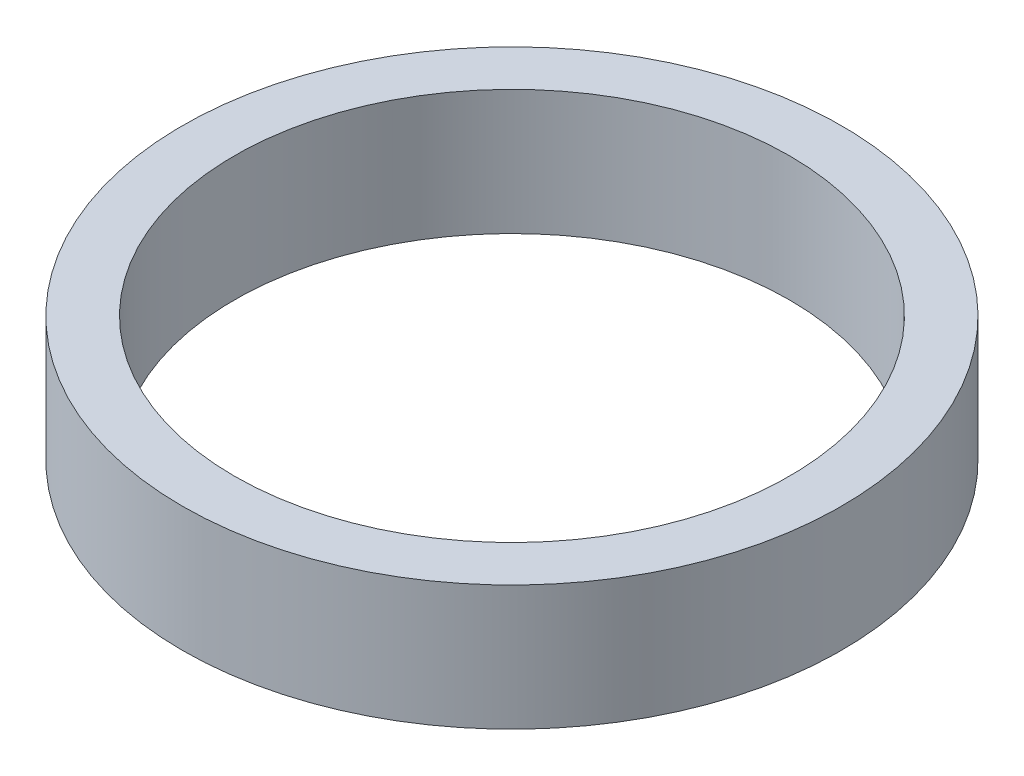
ISO-10303-21;
HEADER;
FILE_DESCRIPTION(('STEP AP214'),'2;1');
FILE_NAME('part.step','',(''),(''),'','','');
FILE_SCHEMA(('AUTOMOTIVE_DESIGN { 1 0 10303 214 1 1 1 1 }'));
ENDSEC;
DATA;
#1=APPLICATION_CONTEXT('core data for automotive mechanical design processes');
#2=APPLICATION_PROTOCOL_DEFINITION('international standard','automotive_design',2000,#1);
#3=PRODUCT_CONTEXT('',#1,'mechanical');
#4=PRODUCT('Part','Part','',(#3));
#5=PRODUCT_RELATED_PRODUCT_CATEGORY('part','',(#4));
#6=PRODUCT_DEFINITION_FORMATION('','',#4);
#7=PRODUCT_DEFINITION_CONTEXT('part definition',#1,'design');
#8=PRODUCT_DEFINITION('design','',#6,#7);
#9=PRODUCT_DEFINITION_SHAPE('','',#8);
#10=(LENGTH_UNIT() NAMED_UNIT(*) SI_UNIT(.MILLI.,.METRE.));
#11=(NAMED_UNIT(*) PLANE_ANGLE_UNIT() SI_UNIT($,.RADIAN.));
#12=(NAMED_UNIT(*) SI_UNIT($,.STERADIAN.) SOLID_ANGLE_UNIT());
#13=UNCERTAINTY_MEASURE_WITH_UNIT(LENGTH_MEASURE(1.E-05),#10,'distance_accuracy_value','');
#14=(GEOMETRIC_REPRESENTATION_CONTEXT(3) GLOBAL_UNCERTAINTY_ASSIGNED_CONTEXT((#13)) GLOBAL_UNIT_ASSIGNED_CONTEXT((#10,
#11,#12)) REPRESENTATION_CONTEXT('',''));
#15=CARTESIAN_POINT('',(0.,0.,0.));
#16=DIRECTION('',(0.,0.,1.));
#17=DIRECTION('',(1.,0.,0.));
#18=AXIS2_PLACEMENT_3D('',#15,#16,#17);
#19=CARTESIAN_POINT('',(0.,18.,0.));
#20=DIRECTION('',(0.,-1.,0.));
#21=DIRECTION('',(0.,0.,-1.));
#22=AXIS2_PLACEMENT_3D('',#19,#20,#21);
#23=CYLINDRICAL_SURFACE('',#22,47.5);
#24=CARTESIAN_POINT('',(0.,18.,0.));
#25=DIRECTION('',(0.,1.,0.));
#26=DIRECTION('',(0.,0.,1.));
#27=AXIS2_PLACEMENT_3D('',#24,#25,#26);
#28=CIRCLE('',#27,47.5);
#29=CARTESIAN_POINT('',(0.,18.,47.5));
#30=VERTEX_POINT('',#29);
#31=EDGE_CURVE('E10',#30,#30,#28,.T.);
#32=ORIENTED_EDGE('',*,*,#31,.F.);
#33=EDGE_LOOP('',(#32));
#34=FACE_BOUND('',#33,.T.);
#35=CARTESIAN_POINT('',(0.,0.,0.));
#36=DIRECTION('',(0.,1.,0.));
#37=DIRECTION('',(0.,0.,1.));
#38=AXIS2_PLACEMENT_3D('',#35,#36,#37);
#39=CIRCLE('',#38,47.5);
#40=CARTESIAN_POINT('',(0.,0.,47.5));
#41=VERTEX_POINT('',#40);
#42=EDGE_CURVE('E37',#41,#41,#39,.T.);
#43=ORIENTED_EDGE('',*,*,#42,.T.);
#44=EDGE_LOOP('',(#43));
#45=FACE_BOUND('',#44,.T.);
#46=ADVANCED_FACE('F40',(#34,#45),#23,.T.);
#47=CARTESIAN_POINT('',(0.,18.,0.));
#48=DIRECTION('',(0.,1.,0.));
#49=DIRECTION('',(0.,0.,1.));
#50=AXIS2_PLACEMENT_3D('',#47,#48,#49);
#51=PLANE('',#50);
#52=CARTESIAN_POINT('',(0.,18.,0.));
#53=DIRECTION('',(0.,1.,0.));
#54=DIRECTION('',(0.,0.,1.));
#55=AXIS2_PLACEMENT_3D('',#52,#53,#54);
#56=CIRCLE('',#55,40.);
#57=CARTESIAN_POINT('',(0.,18.,40.));
#58=VERTEX_POINT('',#57);
#59=EDGE_CURVE('E50',#58,#58,#56,.T.);
#60=ORIENTED_EDGE('',*,*,#59,.F.);
#61=EDGE_LOOP('',(#60));
#62=FACE_BOUND('',#61,.T.);
#63=ORIENTED_EDGE('',*,*,#31,.T.);
#64=EDGE_LOOP('',(#63));
#65=FACE_BOUND('',#64,.T.);
#66=ADVANCED_FACE('F59',(#62,#65),#51,.T.);
#67=CARTESIAN_POINT('',(0.,0.,0.));
#68=DIRECTION('',(0.,1.,0.));
#69=DIRECTION('',(0.,0.,1.));
#70=AXIS2_PLACEMENT_3D('',#67,#68,#69);
#71=PLANE('',#70);
#72=CARTESIAN_POINT('',(0.,0.,0.));
#73=DIRECTION('',(0.,1.,0.));
#74=DIRECTION('',(0.,0.,1.));
#75=AXIS2_PLACEMENT_3D('',#72,#73,#74);
#76=CIRCLE('',#75,40.);
#77=CARTESIAN_POINT('',(0.,0.,40.));
#78=VERTEX_POINT('',#77);
#79=EDGE_CURVE('E47',#78,#78,#76,.T.);
#80=ORIENTED_EDGE('',*,*,#79,.T.);
#81=EDGE_LOOP('',(#80));
#82=FACE_BOUND('',#81,.T.);
#83=ORIENTED_EDGE('',*,*,#42,.F.);
#84=EDGE_LOOP('',(#83));
#85=FACE_BOUND('',#84,.T.);
#86=ADVANCED_FACE('F58',(#82,#85),#71,.F.);
#87=CARTESIAN_POINT('',(0.,18.,0.));
#88=DIRECTION('',(0.,-1.,0.));
#89=DIRECTION('',(0.,0.,-1.));
#90=AXIS2_PLACEMENT_3D('',#87,#88,#89);
#91=CYLINDRICAL_SURFACE('',#90,40.);
#92=ORIENTED_EDGE('',*,*,#59,.T.);
#93=EDGE_LOOP('',(#92));
#94=FACE_BOUND('',#93,.T.);
#95=ORIENTED_EDGE('',*,*,#79,.F.);
#96=EDGE_LOOP('',(#95));
#97=FACE_BOUND('',#96,.T.);
#98=ADVANCED_FACE('F54',(#94,#97),#91,.F.);
#99=CLOSED_SHELL('',(#46,#66,#86,#98));
#100=MANIFOLD_SOLID_BREP('B2',#99);
#101=ADVANCED_BREP_SHAPE_REPRESENTATION('',(#18,#100),#14);
#102=SHAPE_DEFINITION_REPRESENTATION(#9,#101);
ENDSEC;
END-ISO-10303-21;
